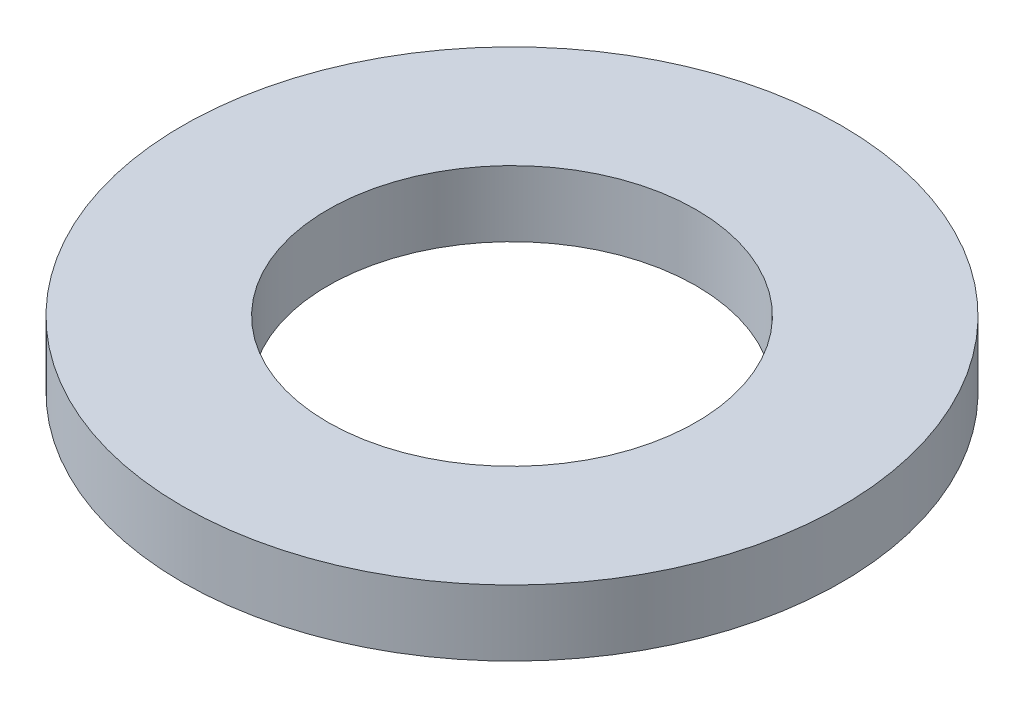
ISO-10303-21;
HEADER;
FILE_DESCRIPTION(('STEP AP214'),'2;1');
FILE_NAME('part.step','',(''),(''),'','','');
FILE_SCHEMA(('AUTOMOTIVE_DESIGN { 1 0 10303 214 1 1 1 1 }'));
ENDSEC;
DATA;
#1=APPLICATION_CONTEXT('core data for automotive mechanical design processes');
#2=APPLICATION_PROTOCOL_DEFINITION('international standard','automotive_design',2000,#1);
#3=PRODUCT_CONTEXT('',#1,'mechanical');
#4=PRODUCT('Part','Part','',(#3));
#5=PRODUCT_RELATED_PRODUCT_CATEGORY('part','',(#4));
#6=PRODUCT_DEFINITION_FORMATION('','',#4);
#7=PRODUCT_DEFINITION_CONTEXT('part definition',#1,'design');
#8=PRODUCT_DEFINITION('design','',#6,#7);
#9=PRODUCT_DEFINITION_SHAPE('','',#8);
#10=(LENGTH_UNIT() NAMED_UNIT(*) SI_UNIT(.MILLI.,.METRE.));
#11=(NAMED_UNIT(*) PLANE_ANGLE_UNIT() SI_UNIT($,.RADIAN.));
#12=(NAMED_UNIT(*) SI_UNIT($,.STERADIAN.) SOLID_ANGLE_UNIT());
#13=UNCERTAINTY_MEASURE_WITH_UNIT(LENGTH_MEASURE(1.E-05),#10,'distance_accuracy_value','');
#14=(GEOMETRIC_REPRESENTATION_CONTEXT(3) GLOBAL_UNCERTAINTY_ASSIGNED_CONTEXT((#13)) GLOBAL_UNIT_ASSIGNED_CONTEXT((#10,
#11,#12)) REPRESENTATION_CONTEXT('',''));
#15=CARTESIAN_POINT('',(0.,0.,0.));
#16=DIRECTION('',(0.,0.,1.));
#17=DIRECTION('',(1.,0.,0.));
#18=AXIS2_PLACEMENT_3D('',#15,#16,#17);
#19=CARTESIAN_POINT('',(0.,17.,0.));
#20=DIRECTION('',(0.,-1.,0.));
#21=DIRECTION('',(0.,0.,-1.));
#22=AXIS2_PLACEMENT_3D('',#19,#20,#21);
#23=CYLINDRICAL_SURFACE('',#22,85.);
#24=CARTESIAN_POINT('',(0.,17.,0.));
#25=DIRECTION('',(0.,1.,0.));
#26=DIRECTION('',(0.,0.,1.));
#27=AXIS2_PLACEMENT_3D('',#24,#25,#26);
#28=CIRCLE('',#27,85.);
#29=CARTESIAN_POINT('',(0.,17.,85.));
#30=VERTEX_POINT('',#29);
#31=EDGE_CURVE('E10',#30,#30,#28,.T.);
#32=ORIENTED_EDGE('',*,*,#31,.F.);
#33=EDGE_LOOP('',(#32));
#34=FACE_BOUND('',#33,.T.);
#35=CARTESIAN_POINT('',(0.,0.,0.));
#36=DIRECTION('',(0.,1.,0.));
#37=DIRECTION('',(0.,0.,1.));
#38=AXIS2_PLACEMENT_3D('',#35,#36,#37);
#39=CIRCLE('',#38,85.);
#40=CARTESIAN_POINT('',(0.,0.,85.));
#41=VERTEX_POINT('',#40);
#42=EDGE_CURVE('E37',#41,#41,#39,.T.);
#43=ORIENTED_EDGE('',*,*,#42,.T.);
#44=EDGE_LOOP('',(#43));
#45=FACE_BOUND('',#44,.T.);
#46=ADVANCED_FACE('F40',(#34,#45),#23,.T.);
#47=CARTESIAN_POINT('',(0.,17.,0.));
#48=DIRECTION('',(0.,1.,0.));
#49=DIRECTION('',(0.,0.,1.));
#50=AXIS2_PLACEMENT_3D('',#47,#48,#49);
#51=PLANE('',#50);
#52=CARTESIAN_POINT('',(0.,17.,0.));
#53=DIRECTION('',(0.,1.,0.));
#54=DIRECTION('',(0.,0.,1.));
#55=AXIS2_PLACEMENT_3D('',#52,#53,#54);
#56=CIRCLE('',#55,47.5);
#57=CARTESIAN_POINT('',(0.,17.,47.5));
#58=VERTEX_POINT('',#57);
#59=EDGE_CURVE('E50',#58,#58,#56,.T.);
#60=ORIENTED_EDGE('',*,*,#59,.F.);
#61=EDGE_LOOP('',(#60));
#62=FACE_BOUND('',#61,.T.);
#63=ORIENTED_EDGE('',*,*,#31,.T.);
#64=EDGE_LOOP('',(#63));
#65=FACE_BOUND('',#64,.T.);
#66=ADVANCED_FACE('F59',(#62,#65),#51,.T.);
#67=CARTESIAN_POINT('',(0.,0.,0.));
#68=DIRECTION('',(0.,1.,0.));
#69=DIRECTION('',(0.,0.,1.));
#70=AXIS2_PLACEMENT_3D('',#67,#68,#69);
#71=PLANE('',#70);
#72=CARTESIAN_POINT('',(0.,0.,0.));
#73=DIRECTION('',(0.,1.,0.));
#74=DIRECTION('',(0.,0.,1.));
#75=AXIS2_PLACEMENT_3D('',#72,#73,#74);
#76=CIRCLE('',#75,47.5);
#77=CARTESIAN_POINT('',(0.,0.,47.5));
#78=VERTEX_POINT('',#77);
#79=EDGE_CURVE('E47',#78,#78,#76,.T.);
#80=ORIENTED_EDGE('',*,*,#79,.T.);
#81=EDGE_LOOP('',(#80));
#82=FACE_BOUND('',#81,.T.);
#83=ORIENTED_EDGE('',*,*,#42,.F.);
#84=EDGE_LOOP('',(#83));
#85=FACE_BOUND('',#84,.T.);
#86=ADVANCED_FACE('F58',(#82,#85),#71,.F.);
#87=CARTESIAN_POINT('',(0.,17.,0.));
#88=DIRECTION('',(0.,-1.,0.));
#89=DIRECTION('',(0.,0.,-1.));
#90=AXIS2_PLACEMENT_3D('',#87,#88,#89);
#91=CYLINDRICAL_SURFACE('',#90,47.5);
#92=ORIENTED_EDGE('',*,*,#59,.T.);
#93=EDGE_LOOP('',(#92));
#94=FACE_BOUND('',#93,.T.);
#95=ORIENTED_EDGE('',*,*,#79,.F.);
#96=EDGE_LOOP('',(#95));
#97=FACE_BOUND('',#96,.T.);
#98=ADVANCED_FACE('F54',(#94,#97),#91,.F.);
#99=CLOSED_SHELL('',(#46,#66,#86,#98));
#100=MANIFOLD_SOLID_BREP('B2',#99);
#101=ADVANCED_BREP_SHAPE_REPRESENTATION('',(#18,#100),#14);
#102=SHAPE_DEFINITION_REPRESENTATION(#9,#101);
ENDSEC;
END-ISO-10303-21;
